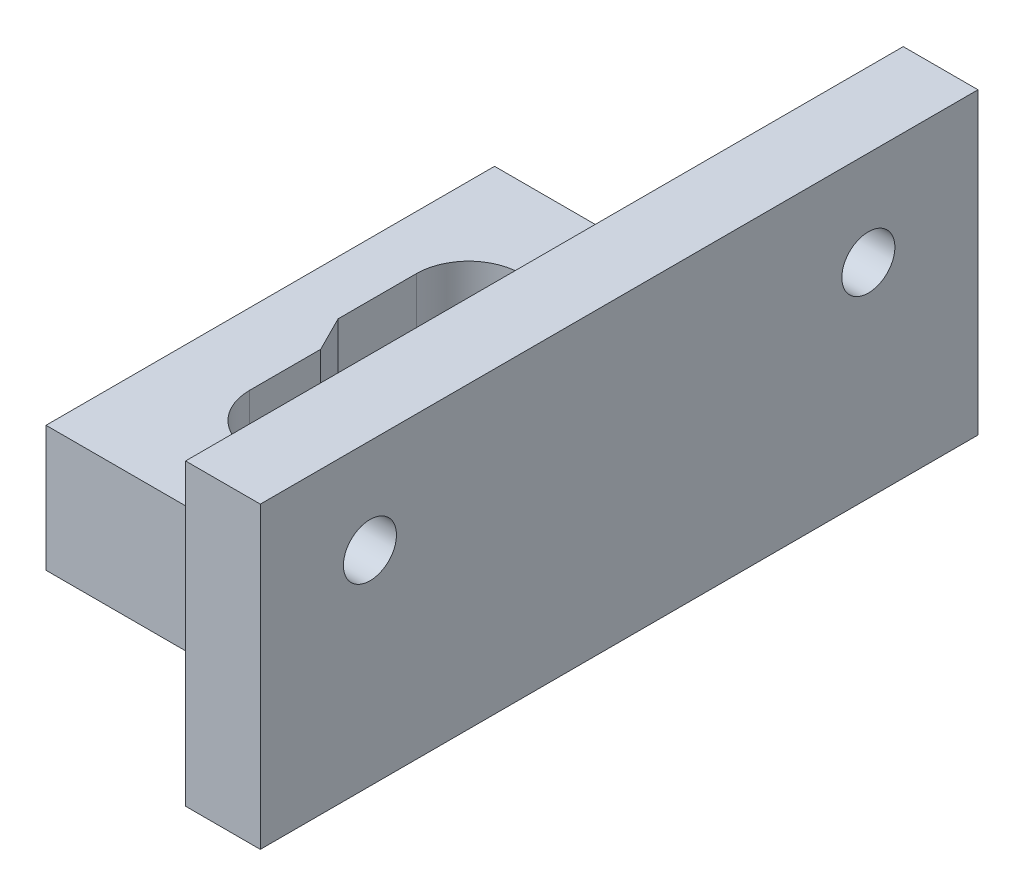
ISO-10303-21;
HEADER;
FILE_DESCRIPTION(('STEP AP214'),'2;1');
FILE_NAME('part.step','',(''),(''),'','','');
FILE_SCHEMA(('AUTOMOTIVE_DESIGN { 1 0 10303 214 1 1 1 1 }'));
ENDSEC;
DATA;
#1=APPLICATION_CONTEXT('core data for automotive mechanical design processes');
#2=APPLICATION_PROTOCOL_DEFINITION('international standard','automotive_design',2000,#1);
#3=PRODUCT_CONTEXT('',#1,'mechanical');
#4=PRODUCT('Part','Part','',(#3));
#5=PRODUCT_RELATED_PRODUCT_CATEGORY('part','',(#4));
#6=PRODUCT_DEFINITION_FORMATION('','',#4);
#7=PRODUCT_DEFINITION_CONTEXT('part definition',#1,'design');
#8=PRODUCT_DEFINITION('design','',#6,#7);
#9=PRODUCT_DEFINITION_SHAPE('','',#8);
#10=(LENGTH_UNIT() NAMED_UNIT(*) SI_UNIT(.MILLI.,.METRE.));
#11=(NAMED_UNIT(*) PLANE_ANGLE_UNIT() SI_UNIT($,.RADIAN.));
#12=(NAMED_UNIT(*) SI_UNIT($,.STERADIAN.) SOLID_ANGLE_UNIT());
#13=UNCERTAINTY_MEASURE_WITH_UNIT(LENGTH_MEASURE(1.E-05),#10,'distance_accuracy_value','');
#14=(GEOMETRIC_REPRESENTATION_CONTEXT(3) GLOBAL_UNCERTAINTY_ASSIGNED_CONTEXT((#13)) GLOBAL_UNIT_ASSIGNED_CONTEXT((#10,
#11,#12)) REPRESENTATION_CONTEXT('',''));
#15=CARTESIAN_POINT('',(0.,0.,0.));
#16=DIRECTION('',(0.,0.,1.));
#17=DIRECTION('',(1.,0.,0.));
#18=AXIS2_PLACEMENT_3D('',#15,#16,#17);
#19=CARTESIAN_POINT('',(0.,6.4008,0.));
#20=DIRECTION('',(0.,-1.,0.));
#21=DIRECTION('',(0.,0.,-1.));
#22=AXIS2_PLACEMENT_3D('',#19,#20,#21);
#23=PLANE('',#22);
#24=DIRECTION('',(0.,0.,1.));
#25=VECTOR('',#24,1.);
#26=CARTESIAN_POINT('',(-3.9751,6.4008,1.07408723709392));
#27=LINE('',#26,#25);
#28=CARTESIAN_POINT('',(-3.9751,6.4008,1.07408723709392));
#29=VERTEX_POINT('',#28);
#30=CARTESIAN_POINT('',(-3.9751,6.4008,4.69899999999999));
#31=VERTEX_POINT('',#30);
#32=EDGE_CURVE('E249',#29,#31,#27,.T.);
#33=ORIENTED_EDGE('',*,*,#32,.F.);
#34=DIRECTION('',(0.450307591949055,0.,0.892873491953392));
#35=VECTOR('',#34,1.);
#36=CARTESIAN_POINT('',(-4.87565140346455,6.4008,-0.711533282459501));
#37=LINE('',#36,#35);
#38=CARTESIAN_POINT('',(-4.87565140346455,6.4008,-0.711533282459504));
#39=VERTEX_POINT('',#38);
#40=EDGE_CURVE('E289',#39,#29,#37,.T.);
#41=ORIENTED_EDGE('',*,*,#40,.F.);
#42=DIRECTION('',(0.,0.,1.));
#43=VECTOR('',#42,1.);
#44=CARTESIAN_POINT('',(-4.87565140346455,6.4008,-4.69899999999998));
#45=LINE('',#44,#43);
#46=CARTESIAN_POINT('',(-4.87565140346455,6.4008,-4.69899999999999));
#47=VERTEX_POINT('',#46);
#48=EDGE_CURVE('E314',#47,#39,#45,.T.);
#49=ORIENTED_EDGE('',*,*,#48,.F.);
#50=CARTESIAN_POINT('',(-2.20865140346455,6.4008,-4.699));
#51=DIRECTION('',(0.,1.,0.));
#52=DIRECTION('',(0.,0.,1.));
#53=AXIS2_PLACEMENT_3D('',#50,#51,#52);
#54=CIRCLE('',#53,2.667);
#55=CARTESIAN_POINT('',(-2.20865140346454,6.4008,-7.366));
#56=VERTEX_POINT('',#55);
#57=EDGE_CURVE('E312',#56,#47,#54,.T.);
#58=ORIENTED_EDGE('',*,*,#57,.F.);
#59=DIRECTION('',(-1.,0.,0.));
#60=VECTOR('',#59,1.);
#61=CARTESIAN_POINT('',(2.20865140346453,6.4008,-7.366));
#62=LINE('',#61,#60);
#63=CARTESIAN_POINT('',(2.20865140346454,6.4008,-7.366));
#64=VERTEX_POINT('',#63);
#65=EDGE_CURVE('E310',#64,#56,#62,.T.);
#66=ORIENTED_EDGE('',*,*,#65,.F.);
#67=CARTESIAN_POINT('',(2.20865140346455,6.4008,-4.699));
#68=DIRECTION('',(0.,1.,0.));
#69=DIRECTION('',(0.,0.,1.));
#70=AXIS2_PLACEMENT_3D('',#67,#68,#69);
#71=CIRCLE('',#70,2.667);
#72=CARTESIAN_POINT('',(4.87565140346455,6.4008,-4.69899999999999));
#73=VERTEX_POINT('',#72);
#74=EDGE_CURVE('E308',#73,#64,#71,.T.);
#75=ORIENTED_EDGE('',*,*,#74,.F.);
#76=DIRECTION('',(0.,0.,-1.));
#77=VECTOR('',#76,1.);
#78=CARTESIAN_POINT('',(4.87565140346455,6.4008,-0.711533282459501));
#79=LINE('',#78,#77);
#80=CARTESIAN_POINT('',(4.87565140346455,6.4008,-0.711533282459501));
#81=VERTEX_POINT('',#80);
#82=EDGE_CURVE('E306',#81,#73,#79,.T.);
#83=ORIENTED_EDGE('',*,*,#82,.F.);
#84=DIRECTION('',(0.450307591949055,0.,-0.892873491953392));
#85=VECTOR('',#84,1.);
#86=CARTESIAN_POINT('',(3.9751,6.4008,1.07408723709392));
#87=LINE('',#86,#85);
#88=CARTESIAN_POINT('',(3.9751,6.4008,1.07408723709392));
#89=VERTEX_POINT('',#88);
#90=EDGE_CURVE('E304',#89,#81,#87,.T.);
#91=ORIENTED_EDGE('',*,*,#90,.F.);
#92=DIRECTION('',(0.,0.,-1.));
#93=VECTOR('',#92,1.);
#94=CARTESIAN_POINT('',(3.9751,6.4008,4.69899999999998));
#95=LINE('',#94,#93);
#96=CARTESIAN_POINT('',(3.9751,6.4008,4.69899999999999));
#97=VERTEX_POINT('',#96);
#98=EDGE_CURVE('E302',#97,#89,#95,.T.);
#99=ORIENTED_EDGE('',*,*,#98,.F.);
#100=CARTESIAN_POINT('',(1.3081,6.4008,4.699));
#101=DIRECTION('',(0.,1.,0.));
#102=DIRECTION('',(0.,0.,1.));
#103=AXIS2_PLACEMENT_3D('',#100,#101,#102);
#104=CIRCLE('',#103,2.667);
#105=CARTESIAN_POINT('',(1.30809999999999,6.4008,7.366));
#106=VERTEX_POINT('',#105);
#107=EDGE_CURVE('E300',#106,#97,#104,.T.);
#108=ORIENTED_EDGE('',*,*,#107,.F.);
#109=DIRECTION('',(1.,0.,0.));
#110=VECTOR('',#109,1.);
#111=CARTESIAN_POINT('',(-1.30809999999998,6.4008,7.366));
#112=LINE('',#111,#110);
#113=CARTESIAN_POINT('',(-1.3081,6.4008,7.366));
#114=VERTEX_POINT('',#113);
#115=EDGE_CURVE('E298',#114,#106,#112,.T.);
#116=ORIENTED_EDGE('',*,*,#115,.F.);
#117=CARTESIAN_POINT('',(-1.3081,6.4008,4.699));
#118=DIRECTION('',(0.,1.,0.));
#119=DIRECTION('',(0.,0.,1.));
#120=AXIS2_PLACEMENT_3D('',#117,#118,#119);
#121=CIRCLE('',#120,2.667);
#122=EDGE_CURVE('E296',#31,#114,#121,.T.);
#123=ORIENTED_EDGE('',*,*,#122,.F.);
#124=EDGE_LOOP('',(#33,#41,#49,#58,#66,#75,#83,#91,#99,#108,#116,#123));
#125=FACE_BOUND('',#124,.T.);
#126=DIRECTION('',(0.,0.,1.));
#127=VECTOR('',#126,1.);
#128=CARTESIAN_POINT('',(6.35,6.4008,0.));
#129=LINE('',#128,#127);
#130=CARTESIAN_POINT('',(6.35,6.4008,-11.43));
#131=VERTEX_POINT('',#130);
#132=CARTESIAN_POINT('',(6.35,6.4008,11.43));
#133=VERTEX_POINT('',#132);
#134=EDGE_CURVE('E196',#131,#133,#129,.T.);
#135=ORIENTED_EDGE('',*,*,#134,.F.);
#136=DIRECTION('',(-1.,0.,0.));
#137=VECTOR('',#136,1.);
#138=CARTESIAN_POINT('',(-7.62,6.4008,-11.43));
#139=LINE('',#138,#137);
#140=CARTESIAN_POINT('',(-7.62,6.4008,-11.43));
#141=VERTEX_POINT('',#140);
#142=EDGE_CURVE('E283',#131,#141,#139,.T.);
#143=ORIENTED_EDGE('',*,*,#142,.T.);
#144=DIRECTION('',(0.,0.,1.));
#145=VECTOR('',#144,1.);
#146=CARTESIAN_POINT('',(-7.62,6.4008,-11.43));
#147=LINE('',#146,#145);
#148=CARTESIAN_POINT('',(-7.62,6.4008,11.43));
#149=VERTEX_POINT('',#148);
#150=EDGE_CURVE('E277',#141,#149,#147,.T.);
#151=ORIENTED_EDGE('',*,*,#150,.T.);
#152=DIRECTION('',(1.,0.,0.));
#153=VECTOR('',#152,1.);
#154=CARTESIAN_POINT('',(7.62,6.4008,11.43));
#155=LINE('',#154,#153);
#156=EDGE_CURVE('E280',#149,#133,#155,.T.);
#157=ORIENTED_EDGE('',*,*,#156,.T.);
#158=EDGE_LOOP('',(#135,#143,#151,#157));
#159=FACE_BOUND('',#158,.T.);
#160=ADVANCED_FACE('F33',(#125,#159),#23,.F.);
#161=CARTESIAN_POINT('',(7.62,6.4008,11.43));
#162=DIRECTION('',(0.,0.,-1.));
#163=DIRECTION('',(-1.,0.,0.));
#164=AXIS2_PLACEMENT_3D('',#161,#162,#163);
#165=PLANE('',#164);
#166=DIRECTION('',(0.,-1.,0.));
#167=VECTOR('',#166,1.);
#168=CARTESIAN_POINT('',(6.35,6.4008,11.43));
#169=LINE('',#168,#167);
#170=CARTESIAN_POINT('',(6.35,0.,11.43));
#171=VERTEX_POINT('',#170);
#172=EDGE_CURVE('E48',#133,#171,#169,.T.);
#173=ORIENTED_EDGE('',*,*,#172,.F.);
#174=ORIENTED_EDGE('',*,*,#156,.F.);
#175=DIRECTION('',(0.,-1.,0.));
#176=VECTOR('',#175,1.);
#177=CARTESIAN_POINT('',(-7.62,6.4008,11.43));
#178=LINE('',#177,#176);
#179=CARTESIAN_POINT('',(-7.62,0.,11.43));
#180=VERTEX_POINT('',#179);
#181=EDGE_CURVE('E41',#149,#180,#178,.T.);
#182=ORIENTED_EDGE('',*,*,#181,.T.);
#183=DIRECTION('',(1.,0.,0.));
#184=VECTOR('',#183,1.);
#185=CARTESIAN_POINT('',(7.62,0.,11.43));
#186=LINE('',#185,#184);
#187=EDGE_CURVE('E53',#180,#171,#186,.T.);
#188=ORIENTED_EDGE('',*,*,#187,.T.);
#189=EDGE_LOOP('',(#173,#174,#182,#188));
#190=FACE_BOUND('',#189,.T.);
#191=ADVANCED_FACE('F375',(#190),#165,.F.);
#192=CARTESIAN_POINT('',(-7.62,6.4008,-11.43));
#193=DIRECTION('',(0.,0.,1.));
#194=DIRECTION('',(1.,0.,0.));
#195=AXIS2_PLACEMENT_3D('',#192,#193,#194);
#196=PLANE('',#195);
#197=DIRECTION('',(0.,1.,0.));
#198=VECTOR('',#197,1.);
#199=CARTESIAN_POINT('',(6.35,6.4008,-11.43));
#200=LINE('',#199,#198);
#201=CARTESIAN_POINT('',(6.35,0.,-11.43));
#202=VERTEX_POINT('',#201);
#203=EDGE_CURVE('E11',#202,#131,#200,.T.);
#204=ORIENTED_EDGE('',*,*,#203,.F.);
#205=DIRECTION('',(-1.,0.,0.));
#206=VECTOR('',#205,1.);
#207=CARTESIAN_POINT('',(-7.62,0.,-11.43));
#208=LINE('',#207,#206);
#209=CARTESIAN_POINT('',(-7.62,0.,-11.43));
#210=VERTEX_POINT('',#209);
#211=EDGE_CURVE('E281',#202,#210,#208,.T.);
#212=ORIENTED_EDGE('',*,*,#211,.T.);
#213=DIRECTION('',(0.,-1.,0.));
#214=VECTOR('',#213,1.);
#215=CARTESIAN_POINT('',(-7.62,6.4008,-11.43));
#216=LINE('',#215,#214);
#217=EDGE_CURVE('E285',#141,#210,#216,.T.);
#218=ORIENTED_EDGE('',*,*,#217,.F.);
#219=ORIENTED_EDGE('',*,*,#142,.F.);
#220=EDGE_LOOP('',(#204,#212,#218,#219));
#221=FACE_BOUND('',#220,.T.);
#222=ADVANCED_FACE('F380',(#221),#196,.F.);
#223=CARTESIAN_POINT('',(0.,0.,0.));
#224=DIRECTION('',(0.,-1.,0.));
#225=DIRECTION('',(0.,0.,-1.));
#226=AXIS2_PLACEMENT_3D('',#223,#224,#225);
#227=PLANE('',#226);
#228=DIRECTION('',(0.,0.,-1.));
#229=VECTOR('',#228,1.);
#230=CARTESIAN_POINT('',(6.35,0.,18.288));
#231=LINE('',#230,#229);
#232=CARTESIAN_POINT('',(6.35,0.,18.288));
#233=VERTEX_POINT('',#232);
#234=EDGE_CURVE('E397',#233,#171,#231,.T.);
#235=ORIENTED_EDGE('',*,*,#234,.T.);
#236=ORIENTED_EDGE('',*,*,#187,.F.);
#237=DIRECTION('',(0.,0.,1.));
#238=VECTOR('',#237,1.);
#239=CARTESIAN_POINT('',(-7.62,0.,-11.43));
#240=LINE('',#239,#238);
#241=EDGE_CURVE('E286',#210,#180,#240,.T.);
#242=ORIENTED_EDGE('',*,*,#241,.F.);
#243=ORIENTED_EDGE('',*,*,#211,.F.);
#244=CARTESIAN_POINT('',(6.35,0.,-18.288));
#245=VERTEX_POINT('',#244);
#246=EDGE_CURVE('E194',#202,#245,#231,.T.);
#247=ORIENTED_EDGE('',*,*,#246,.T.);
#248=DIRECTION('',(-1.,0.,0.));
#249=VECTOR('',#248,1.);
#250=CARTESIAN_POINT('',(10.16,0.,-18.288));
#251=LINE('',#250,#249);
#252=CARTESIAN_POINT('',(10.16,0.,-18.288));
#253=VERTEX_POINT('',#252);
#254=EDGE_CURVE('E173',#253,#245,#251,.T.);
#255=ORIENTED_EDGE('',*,*,#254,.F.);
#256=DIRECTION('',(0.,0.,-1.));
#257=VECTOR('',#256,1.);
#258=CARTESIAN_POINT('',(10.16,0.,18.288));
#259=LINE('',#258,#257);
#260=CARTESIAN_POINT('',(10.16,0.,18.288));
#261=VERTEX_POINT('',#260);
#262=EDGE_CURVE('E179',#261,#253,#259,.T.);
#263=ORIENTED_EDGE('',*,*,#262,.F.);
#264=DIRECTION('',(-1.,0.,0.));
#265=VECTOR('',#264,1.);
#266=CARTESIAN_POINT('',(10.16,0.,18.288));
#267=LINE('',#266,#265);
#268=EDGE_CURVE('E411',#261,#233,#267,.T.);
#269=ORIENTED_EDGE('',*,*,#268,.T.);
#270=EDGE_LOOP('',(#235,#236,#242,#243,#247,#255,#263,#269));
#271=FACE_BOUND('',#270,.T.);
#272=DIRECTION('',(0.450307591949055,0.,0.892873491953392));
#273=VECTOR('',#272,1.);
#274=CARTESIAN_POINT('',(-4.87565140346455,0.,-0.711533282459501));
#275=LINE('',#274,#273);
#276=CARTESIAN_POINT('',(-4.87565140346455,0.,-0.711533282459501));
#277=VERTEX_POINT('',#276);
#278=CARTESIAN_POINT('',(-3.9751,0.,1.07408723709392));
#279=VERTEX_POINT('',#278);
#280=EDGE_CURVE('E205',#277,#279,#275,.T.);
#281=ORIENTED_EDGE('',*,*,#280,.T.);
#282=DIRECTION('',(0.,0.,1.));
#283=VECTOR('',#282,1.);
#284=CARTESIAN_POINT('',(-3.9751,0.,1.07408723709392));
#285=LINE('',#284,#283);
#286=CARTESIAN_POINT('',(-3.9751,0.,4.699));
#287=VERTEX_POINT('',#286);
#288=EDGE_CURVE('E208',#279,#287,#285,.T.);
#289=ORIENTED_EDGE('',*,*,#288,.T.);
#290=CARTESIAN_POINT('',(-1.3081,0.,4.699));
#291=DIRECTION('',(0.,1.,0.));
#292=DIRECTION('',(0.,0.,1.));
#293=AXIS2_PLACEMENT_3D('',#290,#291,#292);
#294=CIRCLE('',#293,2.667);
#295=CARTESIAN_POINT('',(-1.3081,0.,7.366));
#296=VERTEX_POINT('',#295);
#297=EDGE_CURVE('E211',#287,#296,#294,.T.);
#298=ORIENTED_EDGE('',*,*,#297,.T.);
#299=DIRECTION('',(1.,0.,0.));
#300=VECTOR('',#299,1.);
#301=CARTESIAN_POINT('',(-1.30809999999998,0.,7.366));
#302=LINE('',#301,#300);
#303=CARTESIAN_POINT('',(1.30809999999999,0.,7.366));
#304=VERTEX_POINT('',#303);
#305=EDGE_CURVE('E214',#296,#304,#302,.T.);
#306=ORIENTED_EDGE('',*,*,#305,.T.);
#307=CARTESIAN_POINT('',(1.3081,0.,4.699));
#308=DIRECTION('',(0.,1.,0.));
#309=DIRECTION('',(0.,0.,1.));
#310=AXIS2_PLACEMENT_3D('',#307,#308,#309);
#311=CIRCLE('',#310,2.667);
#312=CARTESIAN_POINT('',(3.9751,0.,4.69899999999998));
#313=VERTEX_POINT('',#312);
#314=EDGE_CURVE('E217',#304,#313,#311,.T.);
#315=ORIENTED_EDGE('',*,*,#314,.T.);
#316=DIRECTION('',(0.,0.,-1.));
#317=VECTOR('',#316,1.);
#318=CARTESIAN_POINT('',(3.9751,0.,4.69899999999998));
#319=LINE('',#318,#317);
#320=CARTESIAN_POINT('',(3.9751,0.,1.07408723709392));
#321=VERTEX_POINT('',#320);
#322=EDGE_CURVE('E220',#313,#321,#319,.T.);
#323=ORIENTED_EDGE('',*,*,#322,.T.);
#324=DIRECTION('',(0.450307591949055,0.,-0.892873491953392));
#325=VECTOR('',#324,1.);
#326=CARTESIAN_POINT('',(3.9751,0.,1.07408723709392));
#327=LINE('',#326,#325);
#328=CARTESIAN_POINT('',(4.87565140346455,0.,-0.711533282459501));
#329=VERTEX_POINT('',#328);
#330=EDGE_CURVE('E223',#321,#329,#327,.T.);
#331=ORIENTED_EDGE('',*,*,#330,.T.);
#332=DIRECTION('',(0.,0.,-1.));
#333=VECTOR('',#332,1.);
#334=CARTESIAN_POINT('',(4.87565140346455,0.,-0.711533282459501));
#335=LINE('',#334,#333);
#336=CARTESIAN_POINT('',(4.87565140346455,0.,-4.69899999999998));
#337=VERTEX_POINT('',#336);
#338=EDGE_CURVE('E226',#329,#337,#335,.T.);
#339=ORIENTED_EDGE('',*,*,#338,.T.);
#340=CARTESIAN_POINT('',(2.20865140346455,0.,-4.699));
#341=DIRECTION('',(0.,1.,0.));
#342=DIRECTION('',(0.,0.,1.));
#343=AXIS2_PLACEMENT_3D('',#340,#341,#342);
#344=CIRCLE('',#343,2.667);
#345=CARTESIAN_POINT('',(2.20865140346453,0.,-7.366));
#346=VERTEX_POINT('',#345);
#347=EDGE_CURVE('E229',#337,#346,#344,.T.);
#348=ORIENTED_EDGE('',*,*,#347,.T.);
#349=DIRECTION('',(-1.,0.,0.));
#350=VECTOR('',#349,1.);
#351=CARTESIAN_POINT('',(2.20865140346453,0.,-7.366));
#352=LINE('',#351,#350);
#353=CARTESIAN_POINT('',(-2.20865140346453,0.,-7.366));
#354=VERTEX_POINT('',#353);
#355=EDGE_CURVE('E232',#346,#354,#352,.T.);
#356=ORIENTED_EDGE('',*,*,#355,.T.);
#357=CARTESIAN_POINT('',(-2.20865140346455,0.,-4.699));
#358=DIRECTION('',(0.,1.,0.));
#359=DIRECTION('',(0.,0.,1.));
#360=AXIS2_PLACEMENT_3D('',#357,#358,#359);
#361=CIRCLE('',#360,2.667);
#362=CARTESIAN_POINT('',(-4.87565140346454,0.,-4.69899999999998));
#363=VERTEX_POINT('',#362);
#364=EDGE_CURVE('E235',#354,#363,#361,.T.);
#365=ORIENTED_EDGE('',*,*,#364,.T.);
#366=DIRECTION('',(0.,0.,1.));
#367=VECTOR('',#366,1.);
#368=CARTESIAN_POINT('',(-4.87565140346455,0.,-4.69899999999998));
#369=LINE('',#368,#367);
#370=EDGE_CURVE('E238',#363,#277,#369,.T.);
#371=ORIENTED_EDGE('',*,*,#370,.T.);
#372=EDGE_LOOP('',(#281,#289,#298,#306,#315,#323,#331,#339,#348,#356,#365,#371));
#373=FACE_BOUND('',#372,.T.);
#374=ADVANCED_FACE('F190',(#271,#373),#227,.T.);
#375=CARTESIAN_POINT('',(-7.62,6.4008,-11.43));
#376=DIRECTION('',(1.,0.,0.));
#377=DIRECTION('',(0.,0.,-1.));
#378=AXIS2_PLACEMENT_3D('',#375,#376,#377);
#379=PLANE('',#378);
#380=ORIENTED_EDGE('',*,*,#241,.T.);
#381=ORIENTED_EDGE('',*,*,#181,.F.);
#382=ORIENTED_EDGE('',*,*,#150,.F.);
#383=ORIENTED_EDGE('',*,*,#217,.T.);
#384=EDGE_LOOP('',(#380,#381,#382,#383));
#385=FACE_BOUND('',#384,.T.);
#386=ADVANCED_FACE('F35',(#385),#379,.F.);
#387=CARTESIAN_POINT('',(-4.87565140346455,0.,-0.711533282459501));
#388=DIRECTION('',(-0.892873491953392,0.,0.450307591949055));
#389=DIRECTION('',(0.450307591949055,0.,0.892873491953392));
#390=AXIS2_PLACEMENT_3D('',#387,#388,#389);
#391=PLANE('',#390);
#392=DIRECTION('',(0.,1.,0.));
#393=VECTOR('',#392,1.);
#394=CARTESIAN_POINT('',(-3.9751,0.,1.07408723709392));
#395=LINE('',#394,#393);
#396=EDGE_CURVE('E241',#279,#29,#395,.T.);
#397=ORIENTED_EDGE('',*,*,#396,.F.);
#398=ORIENTED_EDGE('',*,*,#280,.F.);
#399=DIRECTION('',(0.,1.,0.));
#400=VECTOR('',#399,1.);
#401=CARTESIAN_POINT('',(-4.87565140346455,0.,-0.711533282459501));
#402=LINE('',#401,#400);
#403=EDGE_CURVE('E245',#277,#39,#402,.T.);
#404=ORIENTED_EDGE('',*,*,#403,.T.);
#405=ORIENTED_EDGE('',*,*,#40,.T.);
#406=EDGE_LOOP('',(#397,#398,#404,#405));
#407=FACE_BOUND('',#406,.T.);
#408=ADVANCED_FACE('F319',(#407),#391,.F.);
#409=CARTESIAN_POINT('',(-4.87565140346455,0.,-4.69899999999998));
#410=DIRECTION('',(-1.,0.,0.));
#411=DIRECTION('',(0.,0.,1.));
#412=AXIS2_PLACEMENT_3D('',#409,#410,#411);
#413=PLANE('',#412);
#414=ORIENTED_EDGE('',*,*,#403,.F.);
#415=ORIENTED_EDGE('',*,*,#370,.F.);
#416=DIRECTION('',(0.,1.,0.));
#417=VECTOR('',#416,1.);
#418=CARTESIAN_POINT('',(-4.87565140346454,0.,-4.69899999999998));
#419=LINE('',#418,#417);
#420=EDGE_CURVE('E242',#363,#47,#419,.T.);
#421=ORIENTED_EDGE('',*,*,#420,.T.);
#422=ORIENTED_EDGE('',*,*,#48,.T.);
#423=EDGE_LOOP('',(#414,#415,#421,#422));
#424=FACE_BOUND('',#423,.T.);
#425=ADVANCED_FACE('F336',(#424),#413,.F.);
#426=CARTESIAN_POINT('',(-2.20865140346455,0.,-4.699));
#427=DIRECTION('',(0.,1.,0.));
#428=DIRECTION('',(0.,0.,1.));
#429=AXIS2_PLACEMENT_3D('',#426,#427,#428);
#430=CYLINDRICAL_SURFACE('',#429,2.667);
#431=ORIENTED_EDGE('',*,*,#420,.F.);
#432=ORIENTED_EDGE('',*,*,#364,.F.);
#433=DIRECTION('',(0.,1.,0.));
#434=VECTOR('',#433,1.);
#435=CARTESIAN_POINT('',(-2.20865140346453,0.,-7.366));
#436=LINE('',#435,#434);
#437=EDGE_CURVE('E246',#354,#56,#436,.T.);
#438=ORIENTED_EDGE('',*,*,#437,.T.);
#439=ORIENTED_EDGE('',*,*,#57,.T.);
#440=EDGE_LOOP('',(#431,#432,#438,#439));
#441=FACE_BOUND('',#440,.T.);
#442=ADVANCED_FACE('F341',(#441),#430,.F.);
#443=CARTESIAN_POINT('',(2.20865140346453,0.,-7.366));
#444=DIRECTION('',(0.,0.,-1.));
#445=DIRECTION('',(-1.,0.,0.));
#446=AXIS2_PLACEMENT_3D('',#443,#444,#445);
#447=PLANE('',#446);
#448=ORIENTED_EDGE('',*,*,#437,.F.);
#449=ORIENTED_EDGE('',*,*,#355,.F.);
#450=DIRECTION('',(0.,1.,0.));
#451=VECTOR('',#450,1.);
#452=CARTESIAN_POINT('',(2.20865140346453,0.,-7.366));
#453=LINE('',#452,#451);
#454=EDGE_CURVE('E254',#346,#64,#453,.T.);
#455=ORIENTED_EDGE('',*,*,#454,.T.);
#456=ORIENTED_EDGE('',*,*,#65,.T.);
#457=EDGE_LOOP('',(#448,#449,#455,#456));
#458=FACE_BOUND('',#457,.T.);
#459=ADVANCED_FACE('F344',(#458),#447,.F.);
#460=CARTESIAN_POINT('',(2.20865140346455,0.,-4.699));
#461=DIRECTION('',(0.,1.,0.));
#462=DIRECTION('',(0.,0.,1.));
#463=AXIS2_PLACEMENT_3D('',#460,#461,#462);
#464=CYLINDRICAL_SURFACE('',#463,2.667);
#465=ORIENTED_EDGE('',*,*,#454,.F.);
#466=ORIENTED_EDGE('',*,*,#347,.F.);
#467=DIRECTION('',(0.,1.,0.));
#468=VECTOR('',#467,1.);
#469=CARTESIAN_POINT('',(4.87565140346455,0.,-4.69899999999998));
#470=LINE('',#469,#468);
#471=EDGE_CURVE('E257',#337,#73,#470,.T.);
#472=ORIENTED_EDGE('',*,*,#471,.T.);
#473=ORIENTED_EDGE('',*,*,#74,.T.);
#474=EDGE_LOOP('',(#465,#466,#472,#473));
#475=FACE_BOUND('',#474,.T.);
#476=ADVANCED_FACE('F347',(#475),#464,.F.);
#477=CARTESIAN_POINT('',(4.87565140346455,0.,-0.711533282459501));
#478=DIRECTION('',(1.,0.,0.));
#479=DIRECTION('',(0.,0.,-1.));
#480=AXIS2_PLACEMENT_3D('',#477,#478,#479);
#481=PLANE('',#480);
#482=ORIENTED_EDGE('',*,*,#471,.F.);
#483=ORIENTED_EDGE('',*,*,#338,.F.);
#484=DIRECTION('',(0.,1.,0.));
#485=VECTOR('',#484,1.);
#486=CARTESIAN_POINT('',(4.87565140346455,0.,-0.711533282459501));
#487=LINE('',#486,#485);
#488=EDGE_CURVE('E260',#329,#81,#487,.T.);
#489=ORIENTED_EDGE('',*,*,#488,.T.);
#490=ORIENTED_EDGE('',*,*,#82,.T.);
#491=EDGE_LOOP('',(#482,#483,#489,#490));
#492=FACE_BOUND('',#491,.T.);
#493=ADVANCED_FACE('F352',(#492),#481,.F.);
#494=CARTESIAN_POINT('',(3.9751,0.,1.07408723709392));
#495=DIRECTION('',(0.892873491953392,0.,0.450307591949055));
#496=DIRECTION('',(0.450307591949055,0.,-0.892873491953392));
#497=AXIS2_PLACEMENT_3D('',#494,#495,#496);
#498=PLANE('',#497);
#499=ORIENTED_EDGE('',*,*,#488,.F.);
#500=ORIENTED_EDGE('',*,*,#330,.F.);
#501=DIRECTION('',(0.,1.,0.));
#502=VECTOR('',#501,1.);
#503=CARTESIAN_POINT('',(3.9751,0.,1.07408723709392));
#504=LINE('',#503,#502);
#505=EDGE_CURVE('E263',#321,#89,#504,.T.);
#506=ORIENTED_EDGE('',*,*,#505,.T.);
#507=ORIENTED_EDGE('',*,*,#90,.T.);
#508=EDGE_LOOP('',(#499,#500,#506,#507));
#509=FACE_BOUND('',#508,.T.);
#510=ADVANCED_FACE('F356',(#509),#498,.F.);
#511=CARTESIAN_POINT('',(3.9751,0.,4.69899999999998));
#512=DIRECTION('',(1.,0.,0.));
#513=DIRECTION('',(0.,0.,-1.));
#514=AXIS2_PLACEMENT_3D('',#511,#512,#513);
#515=PLANE('',#514);
#516=ORIENTED_EDGE('',*,*,#505,.F.);
#517=ORIENTED_EDGE('',*,*,#322,.F.);
#518=DIRECTION('',(0.,1.,0.));
#519=VECTOR('',#518,1.);
#520=CARTESIAN_POINT('',(3.9751,0.,4.69899999999998));
#521=LINE('',#520,#519);
#522=EDGE_CURVE('E266',#313,#97,#521,.T.);
#523=ORIENTED_EDGE('',*,*,#522,.T.);
#524=ORIENTED_EDGE('',*,*,#98,.T.);
#525=EDGE_LOOP('',(#516,#517,#523,#524));
#526=FACE_BOUND('',#525,.T.);
#527=ADVANCED_FACE('F359',(#526),#515,.F.);
#528=CARTESIAN_POINT('',(1.3081,0.,4.699));
#529=DIRECTION('',(0.,1.,0.));
#530=DIRECTION('',(0.,0.,1.));
#531=AXIS2_PLACEMENT_3D('',#528,#529,#530);
#532=CYLINDRICAL_SURFACE('',#531,2.667);
#533=ORIENTED_EDGE('',*,*,#522,.F.);
#534=ORIENTED_EDGE('',*,*,#314,.F.);
#535=DIRECTION('',(0.,1.,0.));
#536=VECTOR('',#535,1.);
#537=CARTESIAN_POINT('',(1.30809999999999,0.,7.366));
#538=LINE('',#537,#536);
#539=EDGE_CURVE('E269',#304,#106,#538,.T.);
#540=ORIENTED_EDGE('',*,*,#539,.T.);
#541=ORIENTED_EDGE('',*,*,#107,.T.);
#542=EDGE_LOOP('',(#533,#534,#540,#541));
#543=FACE_BOUND('',#542,.T.);
#544=ADVANCED_FACE('F362',(#543),#532,.F.);
#545=CARTESIAN_POINT('',(-1.30809999999998,0.,7.366));
#546=DIRECTION('',(0.,0.,1.));
#547=DIRECTION('',(1.,0.,0.));
#548=AXIS2_PLACEMENT_3D('',#545,#546,#547);
#549=PLANE('',#548);
#550=ORIENTED_EDGE('',*,*,#539,.F.);
#551=ORIENTED_EDGE('',*,*,#305,.F.);
#552=DIRECTION('',(0.,1.,0.));
#553=VECTOR('',#552,1.);
#554=CARTESIAN_POINT('',(-1.3081,0.,7.366));
#555=LINE('',#554,#553);
#556=EDGE_CURVE('E272',#296,#114,#555,.T.);
#557=ORIENTED_EDGE('',*,*,#556,.T.);
#558=ORIENTED_EDGE('',*,*,#115,.T.);
#559=EDGE_LOOP('',(#550,#551,#557,#558));
#560=FACE_BOUND('',#559,.T.);
#561=ADVANCED_FACE('F365',(#560),#549,.F.);
#562=CARTESIAN_POINT('',(-1.3081,0.,4.699));
#563=DIRECTION('',(0.,1.,0.));
#564=DIRECTION('',(0.,0.,1.));
#565=AXIS2_PLACEMENT_3D('',#562,#563,#564);
#566=CYLINDRICAL_SURFACE('',#565,2.667);
#567=ORIENTED_EDGE('',*,*,#556,.F.);
#568=ORIENTED_EDGE('',*,*,#297,.F.);
#569=DIRECTION('',(0.,1.,0.));
#570=VECTOR('',#569,1.);
#571=CARTESIAN_POINT('',(-3.9751,0.,4.69899999999999));
#572=LINE('',#571,#570);
#573=EDGE_CURVE('E251',#287,#31,#572,.T.);
#574=ORIENTED_EDGE('',*,*,#573,.T.);
#575=ORIENTED_EDGE('',*,*,#122,.T.);
#576=EDGE_LOOP('',(#567,#568,#574,#575));
#577=FACE_BOUND('',#576,.T.);
#578=ADVANCED_FACE('F331',(#577),#566,.F.);
#579=CARTESIAN_POINT('',(-3.9751,0.,1.07408723709392));
#580=DIRECTION('',(-1.,0.,0.));
#581=DIRECTION('',(0.,0.,1.));
#582=AXIS2_PLACEMENT_3D('',#579,#580,#581);
#583=PLANE('',#582);
#584=ORIENTED_EDGE('',*,*,#573,.F.);
#585=ORIENTED_EDGE('',*,*,#288,.F.);
#586=ORIENTED_EDGE('',*,*,#396,.T.);
#587=ORIENTED_EDGE('',*,*,#32,.T.);
#588=EDGE_LOOP('',(#584,#585,#586,#587));
#589=FACE_BOUND('',#588,.T.);
#590=ADVANCED_FACE('F329',(#589),#583,.F.);
#591=CARTESIAN_POINT('',(6.35,0.,0.));
#592=DIRECTION('',(1.,0.,0.));
#593=DIRECTION('',(0.,0.,-1.));
#594=AXIS2_PLACEMENT_3D('',#591,#592,#593);
#595=PLANE('',#594);
#596=CARTESIAN_POINT('',(6.35,10.414,12.7));
#597=DIRECTION('',(-1.,0.,0.));
#598=DIRECTION('',(0.,0.,1.));
#599=AXIS2_PLACEMENT_3D('',#596,#597,#598);
#600=CIRCLE('',#599,2.3876);
#601=CARTESIAN_POINT('',(6.35,10.414,15.0876));
#602=VERTEX_POINT('',#601);
#603=EDGE_CURVE('E582',#602,#602,#600,.T.);
#604=ORIENTED_EDGE('',*,*,#603,.F.);
#605=EDGE_LOOP('',(#604));
#606=FACE_BOUND('',#605,.T.);
#607=CARTESIAN_POINT('',(6.35,10.414,-12.7));
#608=DIRECTION('',(-1.,0.,0.));
#609=DIRECTION('',(0.,0.,1.));
#610=AXIS2_PLACEMENT_3D('',#607,#608,#609);
#611=CIRCLE('',#610,2.3876);
#612=CARTESIAN_POINT('',(6.35,10.414,-10.3124));
#613=VERTEX_POINT('',#612);
#614=EDGE_CURVE('E589',#613,#613,#611,.T.);
#615=ORIENTED_EDGE('',*,*,#614,.F.);
#616=EDGE_LOOP('',(#615));
#617=FACE_BOUND('',#616,.T.);
#618=ORIENTED_EDGE('',*,*,#134,.T.);
#619=ORIENTED_EDGE('',*,*,#172,.T.);
#620=ORIENTED_EDGE('',*,*,#234,.F.);
#621=DIRECTION('',(0.,1.,0.));
#622=VECTOR('',#621,1.);
#623=CARTESIAN_POINT('',(6.35,0.,18.288));
#624=LINE('',#623,#622);
#625=CARTESIAN_POINT('',(6.35,15.24,18.288));
#626=VERTEX_POINT('',#625);
#627=EDGE_CURVE('E187',#233,#626,#624,.T.);
#628=ORIENTED_EDGE('',*,*,#627,.T.);
#629=DIRECTION('',(0.,0.,-1.));
#630=VECTOR('',#629,1.);
#631=CARTESIAN_POINT('',(6.35,15.24,18.288));
#632=LINE('',#631,#630);
#633=CARTESIAN_POINT('',(6.35,15.24,-18.288));
#634=VERTEX_POINT('',#633);
#635=EDGE_CURVE('E407',#626,#634,#632,.T.);
#636=ORIENTED_EDGE('',*,*,#635,.T.);
#637=DIRECTION('',(0.,1.,0.));
#638=VECTOR('',#637,1.);
#639=CARTESIAN_POINT('',(6.35,0.,-18.288));
#640=LINE('',#639,#638);
#641=EDGE_CURVE('E396',#245,#634,#640,.T.);
#642=ORIENTED_EDGE('',*,*,#641,.F.);
#643=ORIENTED_EDGE('',*,*,#246,.F.);
#644=ORIENTED_EDGE('',*,*,#203,.T.);
#645=EDGE_LOOP('',(#618,#619,#620,#628,#636,#642,#643,#644));
#646=FACE_BOUND('',#645,.T.);
#647=ADVANCED_FACE('F394',(#606,#617,#646),#595,.F.);
#648=CARTESIAN_POINT('',(10.16,0.,-18.288));
#649=DIRECTION('',(0.,0.,1.));
#650=DIRECTION('',(0.,-1.,0.));
#651=AXIS2_PLACEMENT_3D('',#648,#649,#650);
#652=PLANE('',#651);
#653=ORIENTED_EDGE('',*,*,#641,.T.);
#654=DIRECTION('',(-1.,0.,0.));
#655=VECTOR('',#654,1.);
#656=CARTESIAN_POINT('',(10.16,15.24,-18.288));
#657=LINE('',#656,#655);
#658=CARTESIAN_POINT('',(10.16,15.24,-18.288));
#659=VERTEX_POINT('',#658);
#660=EDGE_CURVE('E174',#659,#634,#657,.T.);
#661=ORIENTED_EDGE('',*,*,#660,.F.);
#662=DIRECTION('',(0.,1.,0.));
#663=VECTOR('',#662,1.);
#664=CARTESIAN_POINT('',(10.16,0.,-18.288));
#665=LINE('',#664,#663);
#666=EDGE_CURVE('E168',#253,#659,#665,.T.);
#667=ORIENTED_EDGE('',*,*,#666,.F.);
#668=ORIENTED_EDGE('',*,*,#254,.T.);
#669=EDGE_LOOP('',(#653,#661,#667,#668));
#670=FACE_BOUND('',#669,.T.);
#671=ADVANCED_FACE('F171',(#670),#652,.F.);
#672=CARTESIAN_POINT('',(10.16,15.24,18.288));
#673=DIRECTION('',(0.,1.,0.));
#674=DIRECTION('',(0.,0.,1.));
#675=AXIS2_PLACEMENT_3D('',#672,#673,#674);
#676=PLANE('',#675);
#677=ORIENTED_EDGE('',*,*,#635,.F.);
#678=DIRECTION('',(-1.,0.,0.));
#679=VECTOR('',#678,1.);
#680=CARTESIAN_POINT('',(10.16,15.24,18.288));
#681=LINE('',#680,#679);
#682=CARTESIAN_POINT('',(10.16,15.24,18.288));
#683=VERTEX_POINT('',#682);
#684=EDGE_CURVE('E200',#683,#626,#681,.T.);
#685=ORIENTED_EDGE('',*,*,#684,.F.);
#686=DIRECTION('',(0.,0.,-1.));
#687=VECTOR('',#686,1.);
#688=CARTESIAN_POINT('',(10.16,15.24,18.288));
#689=LINE('',#688,#687);
#690=EDGE_CURVE('E178',#683,#659,#689,.T.);
#691=ORIENTED_EDGE('',*,*,#690,.T.);
#692=ORIENTED_EDGE('',*,*,#660,.T.);
#693=EDGE_LOOP('',(#677,#685,#691,#692));
#694=FACE_BOUND('',#693,.T.);
#695=ADVANCED_FACE('F417',(#694),#676,.T.);
#696=CARTESIAN_POINT('',(10.16,0.,18.288));
#697=DIRECTION('',(0.,0.,1.));
#698=DIRECTION('',(0.,-1.,0.));
#699=AXIS2_PLACEMENT_3D('',#696,#697,#698);
#700=PLANE('',#699);
#701=ORIENTED_EDGE('',*,*,#627,.F.);
#702=ORIENTED_EDGE('',*,*,#268,.F.);
#703=DIRECTION('',(0.,1.,0.));
#704=VECTOR('',#703,1.);
#705=CARTESIAN_POINT('',(10.16,0.,18.288));
#706=LINE('',#705,#704);
#707=EDGE_CURVE('E185',#261,#683,#706,.T.);
#708=ORIENTED_EDGE('',*,*,#707,.T.);
#709=ORIENTED_EDGE('',*,*,#684,.T.);
#710=EDGE_LOOP('',(#701,#702,#708,#709));
#711=FACE_BOUND('',#710,.T.);
#712=ADVANCED_FACE('F415',(#711),#700,.T.);
#713=CARTESIAN_POINT('',(10.16,0.,0.));
#714=DIRECTION('',(1.,0.,0.));
#715=DIRECTION('',(0.,0.,-1.));
#716=AXIS2_PLACEMENT_3D('',#713,#714,#715);
#717=PLANE('',#716);
#718=CARTESIAN_POINT('',(10.16,10.414,12.7));
#719=DIRECTION('',(-1.,0.,0.));
#720=DIRECTION('',(0.,0.,1.));
#721=AXIS2_PLACEMENT_3D('',#718,#719,#720);
#722=CIRCLE('',#721,1.35255);
#723=CARTESIAN_POINT('',(10.16,10.414,14.05255));
#724=VERTEX_POINT('',#723);
#725=EDGE_CURVE('E584',#724,#724,#722,.T.);
#726=ORIENTED_EDGE('',*,*,#725,.T.);
#727=EDGE_LOOP('',(#726));
#728=FACE_BOUND('',#727,.T.);
#729=CARTESIAN_POINT('',(10.16,10.414,-12.7));
#730=DIRECTION('',(-1.,0.,0.));
#731=DIRECTION('',(0.,0.,1.));
#732=AXIS2_PLACEMENT_3D('',#729,#730,#731);
#733=CIRCLE('',#732,1.35255);
#734=CARTESIAN_POINT('',(10.16,10.414,-11.34745));
#735=VERTEX_POINT('',#734);
#736=EDGE_CURVE('E398',#735,#735,#733,.T.);
#737=ORIENTED_EDGE('',*,*,#736,.T.);
#738=EDGE_LOOP('',(#737));
#739=FACE_BOUND('',#738,.T.);
#740=ORIENTED_EDGE('',*,*,#262,.T.);
#741=ORIENTED_EDGE('',*,*,#666,.T.);
#742=ORIENTED_EDGE('',*,*,#690,.F.);
#743=ORIENTED_EDGE('',*,*,#707,.F.);
#744=EDGE_LOOP('',(#740,#741,#742,#743));
#745=FACE_BOUND('',#744,.T.);
#746=ADVANCED_FACE('F183',(#728,#739,#745),#717,.T.);
#747=CARTESIAN_POINT('',(6.35,10.414,-12.7));
#748=DIRECTION('',(-1.,0.,0.));
#749=DIRECTION('',(0.,0.,1.));
#750=AXIS2_PLACEMENT_3D('',#747,#748,#749);
#751=CYLINDRICAL_SURFACE('',#750,1.35255);
#752=ORIENTED_EDGE('',*,*,#736,.F.);
#753=EDGE_LOOP('',(#752));
#754=FACE_BOUND('',#753,.T.);
#755=CARTESIAN_POINT('',(7.21851007325004,10.414,-12.7));
#756=DIRECTION('',(-1.,0.,0.));
#757=DIRECTION('',(0.,0.,1.));
#758=AXIS2_PLACEMENT_3D('',#755,#756,#757);
#759=CIRCLE('',#758,1.35255);
#760=CARTESIAN_POINT('',(7.21851007325004,10.414,-11.34745));
#761=VERTEX_POINT('',#760);
#762=EDGE_CURVE('E401',#761,#761,#759,.T.);
#763=ORIENTED_EDGE('',*,*,#762,.T.);
#764=EDGE_LOOP('',(#763));
#765=FACE_BOUND('',#764,.T.);
#766=ADVANCED_FACE('F532',(#754,#765),#751,.F.);
#767=CARTESIAN_POINT('',(6.35,10.414,-12.7));
#768=DIRECTION('',(-1.,0.,0.));
#769=DIRECTION('',(0.,0.,1.));
#770=AXIS2_PLACEMENT_3D('',#767,#768,#769);
#771=CONICAL_SURFACE('',#770,2.3876,0.872664625997165);
#772=ORIENTED_EDGE('',*,*,#762,.F.);
#773=EDGE_LOOP('',(#772));
#774=FACE_BOUND('',#773,.T.);
#775=ORIENTED_EDGE('',*,*,#614,.T.);
#776=EDGE_LOOP('',(#775));
#777=FACE_BOUND('',#776,.T.);
#778=ADVANCED_FACE('F542',(#774,#777),#771,.F.);
#779=CARTESIAN_POINT('',(6.35,10.414,12.7));
#780=DIRECTION('',(-1.,0.,0.));
#781=DIRECTION('',(0.,0.,1.));
#782=AXIS2_PLACEMENT_3D('',#779,#780,#781);
#783=CYLINDRICAL_SURFACE('',#782,1.35255);
#784=ORIENTED_EDGE('',*,*,#725,.F.);
#785=EDGE_LOOP('',(#784));
#786=FACE_BOUND('',#785,.T.);
#787=CARTESIAN_POINT('',(7.21851007325004,10.414,12.7));
#788=DIRECTION('',(-1.,0.,0.));
#789=DIRECTION('',(0.,0.,1.));
#790=AXIS2_PLACEMENT_3D('',#787,#788,#789);
#791=CIRCLE('',#790,1.35255);
#792=CARTESIAN_POINT('',(7.21851007325004,10.414,14.05255));
#793=VERTEX_POINT('',#792);
#794=EDGE_CURVE('E579',#793,#793,#791,.T.);
#795=ORIENTED_EDGE('',*,*,#794,.T.);
#796=EDGE_LOOP('',(#795));
#797=FACE_BOUND('',#796,.T.);
#798=ADVANCED_FACE('F552',(#786,#797),#783,.F.);
#799=CARTESIAN_POINT('',(6.35,10.414,12.7));
#800=DIRECTION('',(-1.,0.,0.));
#801=DIRECTION('',(0.,0.,1.));
#802=AXIS2_PLACEMENT_3D('',#799,#800,#801);
#803=CONICAL_SURFACE('',#802,2.3876,0.872664625997165);
#804=ORIENTED_EDGE('',*,*,#794,.F.);
#805=EDGE_LOOP('',(#804));
#806=FACE_BOUND('',#805,.T.);
#807=ORIENTED_EDGE('',*,*,#603,.T.);
#808=EDGE_LOOP('',(#807));
#809=FACE_BOUND('',#808,.T.);
#810=ADVANCED_FACE('F562',(#806,#809),#803,.F.);
#811=CLOSED_SHELL('',(#160,#191,#222,#374,#386,#408,#425,#442,#459,#476,#493,#510,#527,#544,
#561,#578,#590,#647,#671,#695,#712,#746,#766,#778,#798,#810));
#812=MANIFOLD_SOLID_BREP('B2',#811);
#813=ADVANCED_BREP_SHAPE_REPRESENTATION('',(#18,#812),#14);
#814=SHAPE_DEFINITION_REPRESENTATION(#9,#813);
ENDSEC;
END-ISO-10303-21;
